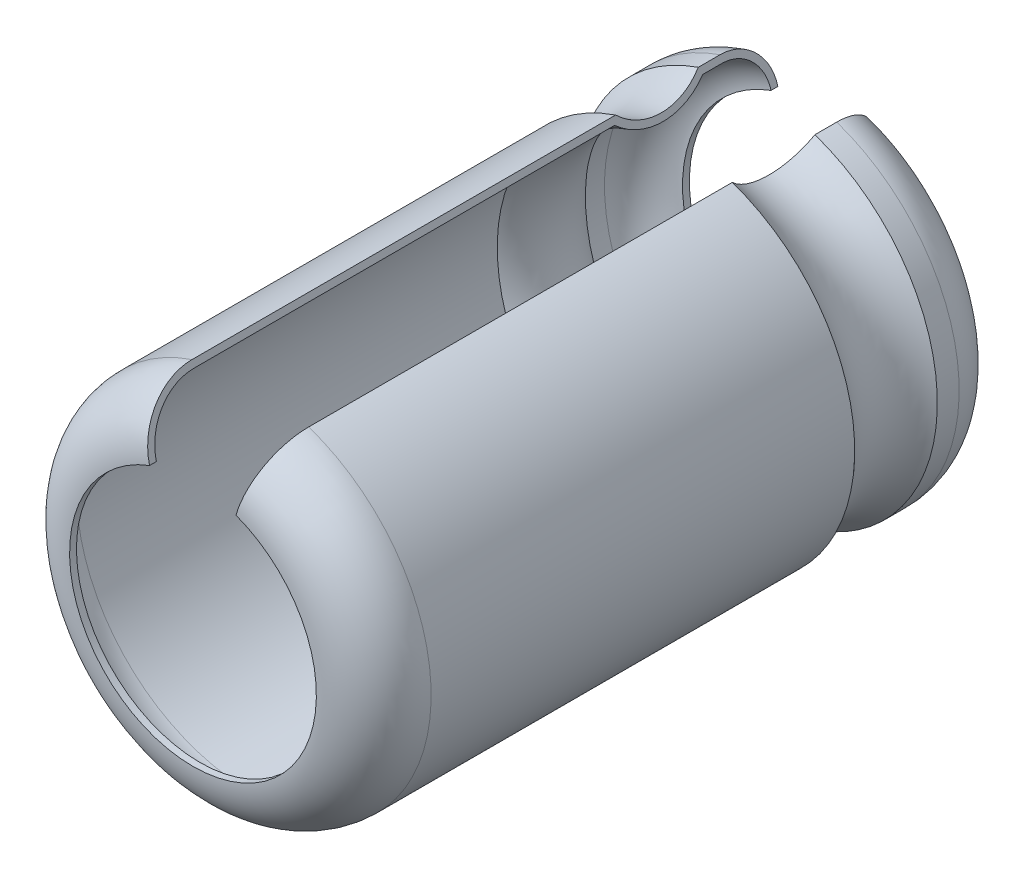
ISO-10303-21;
HEADER;
FILE_DESCRIPTION(('STEP AP214'),'2;1');
FILE_NAME('part.step','',(''),(''),'','','');
FILE_SCHEMA(('AUTOMOTIVE_DESIGN { 1 0 10303 214 1 1 1 1 }'));
ENDSEC;
DATA;
#1=APPLICATION_CONTEXT('core data for automotive mechanical design processes');
#2=APPLICATION_PROTOCOL_DEFINITION('international standard','automotive_design',2000,#1);
#3=PRODUCT_CONTEXT('',#1,'mechanical');
#4=PRODUCT('Part','Part','',(#3));
#5=PRODUCT_RELATED_PRODUCT_CATEGORY('part','',(#4));
#6=PRODUCT_DEFINITION_FORMATION('','',#4);
#7=PRODUCT_DEFINITION_CONTEXT('part definition',#1,'design');
#8=PRODUCT_DEFINITION('design','',#6,#7);
#9=PRODUCT_DEFINITION_SHAPE('','',#8);
#10=(LENGTH_UNIT() NAMED_UNIT(*) SI_UNIT(.MILLI.,.METRE.));
#11=(NAMED_UNIT(*) PLANE_ANGLE_UNIT() SI_UNIT($,.RADIAN.));
#12=(NAMED_UNIT(*) SI_UNIT($,.STERADIAN.) SOLID_ANGLE_UNIT());
#13=UNCERTAINTY_MEASURE_WITH_UNIT(LENGTH_MEASURE(1.E-05),#10,'distance_accuracy_value','');
#14=(GEOMETRIC_REPRESENTATION_CONTEXT(3) GLOBAL_UNCERTAINTY_ASSIGNED_CONTEXT((#13)) GLOBAL_UNIT_ASSIGNED_CONTEXT((#10,
#11,#12)) REPRESENTATION_CONTEXT('',''));
#15=CARTESIAN_POINT('',(0.,0.,0.));
#16=DIRECTION('',(0.,0.,1.));
#17=DIRECTION('',(1.,0.,0.));
#18=AXIS2_PLACEMENT_3D('',#15,#16,#17);
#19=CARTESIAN_POINT('',(-102.183303397109,-58.0021041199526,-4.70000797259886));
#20=DIRECTION('',(0.,0.,-1.));
#21=DIRECTION('',(0.,1.,0.));
#22=AXIS2_PLACEMENT_3D('',#19,#20,#21);
#23=TOROIDAL_SURFACE('',#22,2.35000000000002,0.679999999999987);
#24=CARTESIAN_POINT('',(-101.380450341226,-55.7935011745006,-5.38000797259885));
#25=CARTESIAN_POINT('',(-101.370193619589,-55.7564731285324,-5.38004044292657));
#26=CARTESIAN_POINT('',(-101.359939112595,-55.7194530777049,-5.3767733749197));
#27=CARTESIAN_POINT('',(-101.339726467448,-55.6464829045763,-5.36387228330371));
#28=CARTESIAN_POINT('',(-101.329768131657,-55.6105320687746,-5.35424260990552));
#29=CARTESIAN_POINT('',(-101.310419776922,-55.5406820919637,-5.32884101803197));
#30=CARTESIAN_POINT('',(-101.301030066566,-55.5067840649961,-5.31306579833261));
#31=CARTESIAN_POINT('',(-101.283094480971,-55.4420343612053,-5.2758287346243));
#32=CARTESIAN_POINT('',(-101.27454842846,-55.4111820444102,-5.25436808875672));
#33=CARTESIAN_POINT('',(-101.258557375563,-55.3534523464937,-5.20640512410304));
#34=CARTESIAN_POINT('',(-101.251110429936,-55.3265679428088,-5.17991190699491));
#35=CARTESIAN_POINT('',(-101.237511308953,-55.2774734178036,-5.12260225720216));
#36=CARTESIAN_POINT('',(-101.231359385975,-55.2552642076052,-5.09178498377338));
#37=CARTESIAN_POINT('',(-101.220540454063,-55.2162065123359,-5.02677968656072));
#38=CARTESIAN_POINT('',(-101.215870408837,-55.1993470658777,-4.99259874562344));
#39=CARTESIAN_POINT('',(-101.20813375402,-55.1714167758341,-4.92178886276002));
#40=CARTESIAN_POINT('',(-101.20506615892,-55.1603423744455,-4.88516144109116));
#41=CARTESIAN_POINT('',(-101.201397275565,-55.1470972473639,-4.82358644302531));
#42=CARTESIAN_POINT('',(-101.200308718658,-55.1431674209913,-4.79903089231911));
#43=CARTESIAN_POINT('',(-101.198856561401,-55.1379249519486,-4.74965636537359));
#44=CARTESIAN_POINT('',(-101.198491928441,-55.1366085814251,-4.72483781519092));
#45=CARTESIAN_POINT('',(-101.198492736507,-55.1366114986457,-4.70000797259883));
#46=B_SPLINE_CURVE_WITH_KNOTS('',3,(#24,#25,#26,#27,#28,#29,#30,#31,#32,#33,#34,#35,#36,#37,#38,
#39,#40,#41,#42,#43,#44,#45),.UNSPECIFIED.,.F.,.F.,(4,2,2,2,2,2,2,2,2,2,4),(0.,
0.115116596244857,0.230154566839033,0.34525441816965,0.460330032734128,0.575199474865851,
0.690091282567701,0.804746139704743,0.919330400828832,0.993866780435561,1.06829676417038),.UNSPECIFIED.);
#47=CARTESIAN_POINT('',(-101.380450341226,-55.7935011745006,-5.38000797259884));
#48=VERTEX_POINT('',#47);
#49=CARTESIAN_POINT('',(-101.198492736507,-55.1366114986457,-4.70000797259883));
#50=VERTEX_POINT('',#49);
#51=EDGE_CURVE('E128',#48,#50,#46,.T.);
#52=ORIENTED_EDGE('',*,*,#51,.F.);
#53=CARTESIAN_POINT('',(-102.183303397109,-58.0021041199526,-5.38000797259883));
#54=DIRECTION('',(0.,0.,-1.));
#55=DIRECTION('',(-1.,0.,0.));
#56=AXIS2_PLACEMENT_3D('',#53,#54,#55);
#57=CIRCLE('',#56,2.35);
#58=CARTESIAN_POINT('',(-102.991695495783,-55.7955225522781,-5.38000797259884));
#59=VERTEX_POINT('',#58);
#60=EDGE_CURVE('E127',#48,#59,#57,.T.);
#61=ORIENTED_EDGE('',*,*,#60,.T.);
#62=CARTESIAN_POINT('',(-103.168238701411,-55.1366543391434,-4.70000797259883));
#63=CARTESIAN_POINT('',(-103.168247188603,-55.1366226645133,-4.73819242550071));
#64=CARTESIAN_POINT('',(-103.167404774271,-55.1397665976013,-4.77636674157185));
#65=CARTESIAN_POINT('',(-103.164080899312,-55.1521714678252,-4.85160325200512));
#66=CARTESIAN_POINT('',(-103.161600821129,-55.1614272456102,-4.88866635683986));
#67=CARTESIAN_POINT('',(-103.155062672932,-55.1858279468689,-4.96067316911903));
#68=CARTESIAN_POINT('',(-103.151003875045,-55.2009755867995,-4.99561589035269));
#69=CARTESIAN_POINT('',(-103.14142808588,-55.2367129184884,-5.06237061100815));
#70=CARTESIAN_POINT('',(-103.135911328104,-55.2573017388,-5.09418311064034));
#71=CARTESIAN_POINT('',(-103.123570753034,-55.303357391956,-5.15381348099106));
#72=CARTESIAN_POINT('',(-103.116745772019,-55.3288285678656,-5.1816277562763));
#73=CARTESIAN_POINT('',(-103.101985096685,-55.3839161581668,-5.23245198469534));
#74=CARTESIAN_POINT('',(-103.094049187847,-55.4135333731552,-5.25546100779536));
#75=CARTESIAN_POINT('',(-103.077273156211,-55.4761423755671,-5.29607677261858));
#76=CARTESIAN_POINT('',(-103.068430826868,-55.5091423979345,-5.31366989283923));
#77=CARTESIAN_POINT('',(-103.050110364225,-55.5775152953365,-5.34288231718407));
#78=CARTESIAN_POINT('',(-103.040632568624,-55.6128869100607,-5.35450476623613));
#79=CARTESIAN_POINT('',(-103.024532608894,-55.6729727777734,-5.36864380621674));
#80=CARTESIAN_POINT('',(-103.018009337829,-55.697317956819,-5.37290338426516));
#81=CARTESIAN_POINT('',(-103.004890074079,-55.7462797156935,-5.37858514276228));
#82=CARTESIAN_POINT('',(-102.998294199778,-55.7708958537068,-5.38001140450004));
#83=CARTESIAN_POINT('',(-102.991695495783,-55.7955225522781,-5.38000797259885));
#84=B_SPLINE_CURVE_WITH_KNOTS('',3,(#62,#63,#64,#65,#66,#67,#68,#69,#70,#71,#72,#73,#74,#75,#76,
#77,#78,#79,#80,#81,#82,#83),.UNSPECIFIED.,.F.,.F.,(4,2,2,2,2,2,2,2,2,2,4),(0.,
0.114400278446881,0.228704108446448,0.343060701079718,0.457398989713757,0.571839463176005,
0.686302065563973,0.801050243405509,0.91573791787932,0.992273284410738,1.06869832435833),.UNSPECIFIED.);
#85=CARTESIAN_POINT('',(-103.168238701411,-55.1366543391434,-4.70000797259883));
#86=VERTEX_POINT('',#85);
#87=EDGE_CURVE('E22',#86,#59,#84,.T.);
#88=ORIENTED_EDGE('',*,*,#87,.F.);
#89=CARTESIAN_POINT('',(-102.183303397109,-58.0021041199526,-4.70000797259884));
#90=DIRECTION('',(0.,0.,1.));
#91=DIRECTION('',(1.,0.,0.));
#92=AXIS2_PLACEMENT_3D('',#89,#90,#91);
#93=CIRCLE('',#92,3.03);
#94=EDGE_CURVE('E119',#86,#50,#93,.T.);
#95=ORIENTED_EDGE('',*,*,#94,.T.);
#96=EDGE_LOOP('',(#52,#61,#88,#95));
#97=FACE_BOUND('',#96,.T.);
#98=ADVANCED_FACE('F17',(#97),#23,.F.);
#99=CARTESIAN_POINT('',(-102.183303397109,-58.0021041199526,-5.50000797259884));
#100=DIRECTION('',(0.,0.,-1.));
#101=DIRECTION('',(-1.,0.,0.));
#102=AXIS2_PLACEMENT_3D('',#99,#100,#101);
#103=CYLINDRICAL_SURFACE('',#102,2.35);
#104=ORIENTED_EDGE('',*,*,#60,.F.);
#105=DIRECTION('',(0.,0.,-1.));
#106=VECTOR('',#105,1.);
#107=CARTESIAN_POINT('',(-101.380450341226,-55.7935011745006,-5.50000797259884));
#108=LINE('',#107,#106);
#109=CARTESIAN_POINT('',(-101.380450341226,-55.7935011745006,-5.50000797259884));
#110=VERTEX_POINT('',#109);
#111=EDGE_CURVE('E144',#110,#48,#108,.F.);
#112=ORIENTED_EDGE('',*,*,#111,.F.);
#113=CARTESIAN_POINT('',(-102.183303397109,-58.0021041199526,-5.50000797259884));
#114=DIRECTION('',(0.,0.,1.));
#115=DIRECTION('',(1.,0.,0.));
#116=AXIS2_PLACEMENT_3D('',#113,#114,#115);
#117=CIRCLE('',#116,2.34999999999992);
#118=CARTESIAN_POINT('',(-102.991695495783,-55.7955225522781,-5.50000797259884));
#119=VERTEX_POINT('',#118);
#120=EDGE_CURVE('E135',#119,#110,#117,.T.);
#121=ORIENTED_EDGE('',*,*,#120,.F.);
#122=DIRECTION('',(0.,0.,-1.));
#123=VECTOR('',#122,1.);
#124=CARTESIAN_POINT('',(-102.991695495783,-55.795522552278,-5.50000797259884));
#125=LINE('',#124,#123);
#126=EDGE_CURVE('E139',#59,#119,#125,.T.);
#127=ORIENTED_EDGE('',*,*,#126,.F.);
#128=EDGE_LOOP('',(#104,#112,#121,#127));
#129=FACE_BOUND('',#128,.T.);
#130=ADVANCED_FACE('F293',(#129),#103,.F.);
#131=CARTESIAN_POINT('',(-102.183303397109,-58.0021041199526,-4.50980814949919));
#132=DIRECTION('',(0.,0.,1.));
#133=DIRECTION('',(1.,0.,0.));
#134=AXIS2_PLACEMENT_3D('',#131,#132,#133);
#135=CYLINDRICAL_SURFACE('',#134,3.03);
#136=ORIENTED_EDGE('',*,*,#94,.F.);
#137=DIRECTION('',(0.,0.,1.));
#138=VECTOR('',#137,1.);
#139=CARTESIAN_POINT('',(-103.168238701411,-55.1366543391434,-4.50980814949919));
#140=LINE('',#139,#138);
#141=CARTESIAN_POINT('',(-103.168238701411,-55.1366543391434,-4.36766285414183));
#142=VERTEX_POINT('',#141);
#143=EDGE_CURVE('E107',#142,#86,#140,.F.);
#144=ORIENTED_EDGE('',*,*,#143,.F.);
#145=CARTESIAN_POINT('',(-102.183303397109,-58.0021041199526,-4.36766285414182));
#146=DIRECTION('',(0.,0.,-1.));
#147=DIRECTION('',(0.,1.,0.));
#148=AXIS2_PLACEMENT_3D('',#145,#146,#147);
#149=CIRCLE('',#148,3.03000000000001);
#150=CARTESIAN_POINT('',(-101.198492736507,-55.1366114986457,-4.36766285414181));
#151=VERTEX_POINT('',#150);
#152=EDGE_CURVE('E272',#151,#142,#149,.T.);
#153=ORIENTED_EDGE('',*,*,#152,.F.);
#154=DIRECTION('',(0.,0.,1.));
#155=VECTOR('',#154,1.);
#156=CARTESIAN_POINT('',(-101.198492736507,-55.1366114986457,-4.50980814949919));
#157=LINE('',#156,#155);
#158=EDGE_CURVE('E120',#50,#151,#157,.T.);
#159=ORIENTED_EDGE('',*,*,#158,.F.);
#160=EDGE_LOOP('',(#136,#144,#153,#159));
#161=FACE_BOUND('',#160,.T.);
#162=ADVANCED_FACE('F130',(#161),#135,.F.);
#163=CARTESIAN_POINT('',(-102.183303397109,-58.0021041199526,-4.70000797259883));
#164=DIRECTION('',(0.,0.,-1.));
#165=DIRECTION('',(-1.,0.,0.));
#166=AXIS2_PLACEMENT_3D('',#163,#164,#165);
#167=TOROIDAL_SURFACE('',#166,2.34999999999996,0.800000000000009);
#168=CARTESIAN_POINT('',(-103.199368810584,-55.0204751900654,-4.70000797259884));
#169=CARTESIAN_POINT('',(-103.199378785318,-55.0204379638493,-4.74493641312418));
#170=CARTESIAN_POINT('',(-103.198387652645,-55.0241369213428,-4.7898529829681));
#171=CARTESIAN_POINT('',(-103.194476912161,-55.0387320035236,-4.87837793120833));
#172=CARTESIAN_POINT('',(-103.191558920058,-55.0496220983103,-4.9219873736552));
#173=CARTESIAN_POINT('',(-103.183866191699,-55.0783317513936,-5.00671267685617));
#174=CARTESIAN_POINT('',(-103.179090595329,-55.096154519685,-5.04782737227307));
#175=CARTESIAN_POINT('',(-103.167823492858,-55.1382039185586,-5.12637270836324));
#176=CARTESIAN_POINT('',(-103.161332263984,-55.1624295145218,-5.1638039428992));
#177=CARTESIAN_POINT('',(-103.146812273772,-55.2166188557162,-5.23396212342205));
#178=CARTESIAN_POINT('',(-103.138782279243,-55.246587203283,-5.26668525918337));
#179=CARTESIAN_POINT('',(-103.121415336978,-55.3114015141877,-5.32647783980558));
#180=CARTESIAN_POINT('',(-103.112078138525,-55.3462484132167,-5.35354619760968));
#181=CARTESIAN_POINT('',(-103.092341532381,-55.4199064301136,-5.40132080660216));
#182=CARTESIAN_POINT('',(-103.081939712501,-55.4587265503969,-5.42201216397439));
#183=CARTESIAN_POINT('',(-103.060388263871,-55.5391576516605,-5.45636677497446));
#184=CARTESIAN_POINT('',(-103.04923903229,-55.5807671503881,-5.4700337283675));
#185=CARTESIAN_POINT('',(-103.030303647275,-55.651434969323,-5.48665409186292));
#186=CARTESIAN_POINT('',(-103.022633853254,-55.680059030294,-5.49165957220919));
#187=CARTESIAN_POINT('',(-103.007208884843,-55.7376257961087,-5.49833613325166));
#188=CARTESIAN_POINT('',(-102.999453849753,-55.7665679810782,-5.50001201894142));
#189=CARTESIAN_POINT('',(-102.991695495783,-55.7955225522781,-5.50000797259884));
#190=B_SPLINE_CURVE_WITH_KNOTS('',3,(#168,#169,#170,#171,#172,#173,#174,#175,#176,#177,#178,
#179,#180,#181,#182,#183,#184,#185,#186,#187,#188,#189),.UNSPECIFIED.,.F.,.F.,(4,2,2,2,2,2,2,2,
2,2,4),(0.,0.134605317767995,0.269097909588953,0.403652848989142,0.538186059225175,
0.672827540936546,0.80749488193471,0.942474402822807,1.07738275673046,1.16736871131629,
1.25722471107065),.UNSPECIFIED.);
#191=CARTESIAN_POINT('',(-103.199368810584,-55.0204751900654,-4.70000797259884));
#192=VERTEX_POINT('',#191);
#193=EDGE_CURVE('E212',#192,#119,#190,.T.);
#194=ORIENTED_EDGE('',*,*,#193,.T.);
#195=ORIENTED_EDGE('',*,*,#120,.T.);
#196=CARTESIAN_POINT('',(-101.380450341226,-55.7935011745006,-5.50000797259884));
#197=CARTESIAN_POINT('',(-101.368385278071,-55.7499447898287,-5.50004627126708));
#198=CARTESIAN_POINT('',(-101.356322790121,-55.7063977019684,-5.49620361420081));
#199=CARTESIAN_POINT('',(-101.332546408327,-55.6205619945041,-5.48102891395987));
#200=CARTESIAN_POINT('',(-101.320832282098,-55.5782725359607,-5.46970198607633));
#201=CARTESIAN_POINT('',(-101.298072518044,-55.4961069454905,-5.43982250294661));
#202=CARTESIAN_POINT('',(-101.287027245547,-55.4562321324477,-5.42126603931987));
#203=CARTESIAN_POINT('',(-101.265929371891,-55.3800661738501,-5.37746358079339));
#204=CARTESIAN_POINT('',(-101.255876561445,-55.3437742727507,-5.35221900040055));
#205=CARTESIAN_POINT('',(-101.237066488026,-55.2758675587105,-5.29580037020729));
#206=CARTESIAN_POINT('',(-101.228306888523,-55.2442443106089,-5.26463725273348));
#207=CARTESIAN_POINT('',(-101.212310508867,-55.1864953824259,-5.19722626461126));
#208=CARTESIAN_POINT('',(-101.205074026569,-55.1603707776389,-5.16097740171867));
#209=CARTESIAN_POINT('',(-101.192346720777,-55.1144236143478,-5.08451136666863));
#210=CARTESIAN_POINT('',(-101.186852503574,-55.0945888041276,-5.04430211169449));
#211=CARTESIAN_POINT('',(-101.177750021932,-55.0617277086864,-4.96100382357785));
#212=CARTESIAN_POINT('',(-101.174140601494,-55.0486972501623,-4.9179165739274));
#213=CARTESIAN_POINT('',(-101.169822070645,-55.0331068144993,-4.84546555182945));
#214=CARTESIAN_POINT('',(-101.168540329019,-55.0284795671665,-4.81656267930479));
#215=CARTESIAN_POINT('',(-101.166830459815,-55.0223067258091,-4.75844662051833));
#216=CARTESIAN_POINT('',(-101.166401116266,-55.0207567419838,-4.72923393614812));
#217=CARTESIAN_POINT('',(-101.166402068602,-55.0207601800354,-4.70000797259884));
#218=B_SPLINE_CURVE_WITH_KNOTS('',3,(#196,#197,#198,#199,#200,#201,#202,#203,#204,#205,#206,
#207,#208,#209,#210,#211,#212,#213,#214,#215,#216,#217),.UNSPECIFIED.,.F.,.F.,(4,2,2,2,2,2,2,2,
2,2,4),(0.,0.135412750442454,0.270733045634015,0.406126598468236,0.54149153899714,
0.67660883235841,0.81175252426284,0.946631333100108,1.08142731946295,1.16916036060342,
1.25676815797506),.UNSPECIFIED.);
#219=CARTESIAN_POINT('',(-101.166402068602,-55.0207601800354,-4.70000797259884));
#220=VERTEX_POINT('',#219);
#221=EDGE_CURVE('E132',#110,#220,#218,.T.);
#222=ORIENTED_EDGE('',*,*,#221,.T.);
#223=CARTESIAN_POINT('',(-102.183303397109,-58.0021041199526,-4.70000797259884));
#224=DIRECTION('',(0.,0.,1.));
#225=DIRECTION('',(1.,0.,0.));
#226=AXIS2_PLACEMENT_3D('',#223,#224,#225);
#227=CIRCLE('',#226,3.15);
#228=EDGE_CURVE('E182',#192,#220,#227,.T.);
#229=ORIENTED_EDGE('',*,*,#228,.F.);
#230=EDGE_LOOP('',(#194,#195,#222,#229));
#231=FACE_BOUND('',#230,.T.);
#232=ADVANCED_FACE('F222',(#231),#167,.T.);
#233=CARTESIAN_POINT('',(-102.183303397109,-58.0021041199526,0.810125243112793));
#234=DIRECTION('',(0.,0.,1.));
#235=DIRECTION('',(1.,0.,0.));
#236=AXIS2_PLACEMENT_3D('',#233,#234,#235);
#237=CYLINDRICAL_SURFACE('',#236,3.03);
#238=CARTESIAN_POINT('',(-102.183303397109,-58.0021041199526,-2.8316870134333));
#239=DIRECTION('',(0.,0.,1.));
#240=DIRECTION('',(0.,-1.,0.));
#241=AXIS2_PLACEMENT_3D('',#238,#239,#240);
#242=CIRCLE('',#241,3.02999999999999);
#243=CARTESIAN_POINT('',(-103.168238701411,-55.1366543391434,-2.8316870134333));
#244=VERTEX_POINT('',#243);
#245=CARTESIAN_POINT('',(-101.198492736507,-55.1366114986457,-2.83168701343331));
#246=VERTEX_POINT('',#245);
#247=EDGE_CURVE('E268',#244,#246,#242,.T.);
#248=ORIENTED_EDGE('',*,*,#247,.F.);
#249=DIRECTION('',(0.,0.,1.));
#250=VECTOR('',#249,1.);
#251=CARTESIAN_POINT('',(-103.168238701411,-55.1366543391434,-7.97259882290291E-06));
#252=LINE('',#251,#250);
#253=CARTESIAN_POINT('',(-103.168238701411,-55.1366543391433,4.49999202740116));
#254=VERTEX_POINT('',#253);
#255=EDGE_CURVE('E258',#244,#254,#252,.T.);
#256=ORIENTED_EDGE('',*,*,#255,.T.);
#257=CARTESIAN_POINT('',(-102.183303397109,-58.0021041199526,4.49999202740116));
#258=DIRECTION('',(0.,0.,1.));
#259=DIRECTION('',(1.,0.,0.));
#260=AXIS2_PLACEMENT_3D('',#257,#258,#259);
#261=CIRCLE('',#260,3.03);
#262=CARTESIAN_POINT('',(-101.198492736507,-55.1366114986457,4.49999202740116));
#263=VERTEX_POINT('',#262);
#264=EDGE_CURVE('E218',#254,#263,#261,.T.);
#265=ORIENTED_EDGE('',*,*,#264,.T.);
#266=DIRECTION('',(0.,0.,1.));
#267=VECTOR('',#266,1.);
#268=CARTESIAN_POINT('',(-101.198492736507,-55.1366114986457,0.));
#269=LINE('',#268,#267);
#270=EDGE_CURVE('E240',#263,#246,#269,.F.);
#271=ORIENTED_EDGE('',*,*,#270,.T.);
#272=EDGE_LOOP('',(#248,#256,#265,#271));
#273=FACE_BOUND('',#272,.T.);
#274=ADVANCED_FACE('F196',(#273),#237,.F.);
#275=CARTESIAN_POINT('',(-102.183303397109,-58.0021041199526,-3.59967493378755));
#276=DIRECTION('',(0.,0.,-1.));
#277=DIRECTION('',(0.,1.,0.));
#278=AXIS2_PLACEMENT_3D('',#275,#276,#277);
#279=TOROIDAL_SURFACE('',#278,3.87090333435166,1.13882565106946);
#280=CARTESIAN_POINT('',(-103.168238701411,-55.1366543391434,-4.36766285414182));
#281=CARTESIAN_POINT('',(-103.162642491214,-55.1575396799303,-4.34404430507189));
#282=CARTESIAN_POINT('',(-103.157306443181,-55.1774540822979,-4.31952613097968));
#283=CARTESIAN_POINT('',(-103.147186898964,-55.2152207354682,-4.26884426337275));
#284=CARTESIAN_POINT('',(-103.142403383931,-55.2330730566087,-4.24268062603211));
#285=CARTESIAN_POINT('',(-103.128943010349,-55.283307854704,-4.16203095950649));
#286=CARTESIAN_POINT('',(-103.121139209682,-55.3124320352864,-4.10531382367499));
#287=CARTESIAN_POINT('',(-103.108108449266,-55.3610634952222,-3.98761660963492));
#288=CARTESIAN_POINT('',(-103.102882918574,-55.3805654412612,-3.92663418863817));
#289=CARTESIAN_POINT('',(-103.095161445725,-55.4093823702426,-3.80215073157813));
#290=CARTESIAN_POINT('',(-103.092664749771,-55.4187001663943,-3.73865039607374));
#291=CARTESIAN_POINT('',(-103.090474877393,-55.4268728813707,-3.61105011090485));
#292=CARTESIAN_POINT('',(-103.090776651889,-55.4257466436196,-3.5469514494989));
#293=CARTESIAN_POINT('',(-103.094163609646,-55.4131063451867,-3.4198327238548));
#294=CARTESIAN_POINT('',(-103.097249901329,-55.4015881478195,-3.35681309932481));
#295=CARTESIAN_POINT('',(-103.106114863012,-55.3685036604088,-3.23368910680917));
#296=CARTESIAN_POINT('',(-103.111893120365,-55.3469389103886,-3.17358429357432));
#297=CARTESIAN_POINT('',(-103.125973951966,-55.2943885314415,-3.05801466116261));
#298=CARTESIAN_POINT('',(-103.134273261856,-55.2634150852624,-3.00254395928749));
#299=CARTESIAN_POINT('',(-103.14744876732,-55.2142434294581,-2.92939976225895));
#300=CARTESIAN_POINT('',(-103.151374124308,-55.1995937977384,-2.90909215039443));
#301=CARTESIAN_POINT('',(-103.159558834685,-55.1690480427678,-2.86956700930124));
#302=CARTESIAN_POINT('',(-103.163817581924,-55.1531541816969,-2.85034760641221));
#303=CARTESIAN_POINT('',(-103.168238701411,-55.1366543391434,-2.8316870134333));
#304=B_SPLINE_CURVE_WITH_KNOTS('',3,(#280,#281,#282,#283,#284,#285,#286,#287,#288,#289,#290,
#291,#292,#293,#294,#295,#296,#297,#298,#299,#300,#301,#302,#303),.UNSPECIFIED.,.F.,.F.,(4,2,2,
2,2,2,2,2,2,2,2,4),(0.,0.0960046075440339,0.192005939387046,0.383718292499265,0.575536786952144,
0.767302281198994,0.958721854076197,1.15021765820473,1.34168411783741,1.53290370841602,
1.60889711273796,1.68475542381574),.UNSPECIFIED.);
#305=EDGE_CURVE('E115',#142,#244,#304,.T.);
#306=ORIENTED_EDGE('',*,*,#305,.T.);
#307=ORIENTED_EDGE('',*,*,#247,.T.);
#308=CARTESIAN_POINT('',(-101.198492736507,-55.1366114986457,-2.83168701343332));
#309=CARTESIAN_POINT('',(-101.20426372336,-55.1574454818652,-2.85531464130312));
#310=CARTESIAN_POINT('',(-101.209766141486,-55.1773098984384,-2.87984215721686));
#311=CARTESIAN_POINT('',(-101.220200658919,-55.2149798094342,-2.93054273570695));
#312=CARTESIAN_POINT('',(-101.225132779478,-55.2327853805727,-2.95671573691372));
#313=CARTESIAN_POINT('',(-101.239010352684,-55.2828851528752,-3.03739189510687));
#314=CARTESIAN_POINT('',(-101.24705490123,-55.3119269777273,-3.09412555979166));
#315=CARTESIAN_POINT('',(-101.260485882455,-55.3604144972056,-3.21185123857168));
#316=CARTESIAN_POINT('',(-101.265870881654,-55.3798550167926,-3.27284552894459));
#317=CARTESIAN_POINT('',(-101.273826410311,-55.4085754687281,-3.39734929837576));
#318=CARTESIAN_POINT('',(-101.276397692902,-55.4178581199825,-3.46085809966918));
#319=CARTESIAN_POINT('',(-101.27865049849,-55.425991029484,-3.58849819671718));
#320=CARTESIAN_POINT('',(-101.278336086955,-55.4248559645788,-3.65262848959963));
#321=CARTESIAN_POINT('',(-101.274835532322,-55.4122185252085,-3.77980851406507));
#322=CARTESIAN_POINT('',(-101.271648241408,-55.4007120069779,-3.84285780348769));
#323=CARTESIAN_POINT('',(-101.262494769909,-55.3676668317847,-3.96604708725425));
#324=CARTESIAN_POINT('',(-101.256528615548,-55.3461282694879,-4.02618710904511));
#325=CARTESIAN_POINT('',(-101.241990172887,-55.2936426759258,-4.14181987917302));
#326=CARTESIAN_POINT('',(-101.233421284766,-55.2627079197278,-4.19731857096242));
#327=CARTESIAN_POINT('',(-101.219837568257,-55.2136690068008,-4.27038674428785));
#328=CARTESIAN_POINT('',(-101.215806437913,-55.1991161228518,-4.29060030748223));
#329=CARTESIAN_POINT('',(-101.207402727287,-55.1687776780395,-4.32994687871364));
#330=CARTESIAN_POINT('',(-101.203030764672,-55.1529943470301,-4.34908173790999));
#331=CARTESIAN_POINT('',(-101.198492736507,-55.1366114986457,-4.36766285414181));
#332=B_SPLINE_CURVE_WITH_KNOTS('',3,(#308,#309,#310,#311,#312,#313,#314,#315,#316,#317,#318,
#319,#320,#321,#322,#323,#324,#325,#326,#327,#328,#329,#330,#331),.UNSPECIFIED.,.F.,.F.,(4,2,2,
2,2,2,2,2,2,2,2,4),(0.,0.0960173188838626,0.19203105885433,0.383764295196861,0.575600761993426,
0.767385868311948,0.958900822497749,1.15049232767277,1.34208202496241,1.53342250063315,
1.60907286815092,1.68458919177717),.UNSPECIFIED.);
#333=EDGE_CURVE('E234',#246,#151,#332,.T.);
#334=ORIENTED_EDGE('',*,*,#333,.T.);
#335=ORIENTED_EDGE('',*,*,#152,.T.);
#336=EDGE_LOOP('',(#306,#307,#334,#335));
#337=FACE_BOUND('',#336,.T.);
#338=ADVANCED_FACE('F228',(#337),#279,.T.);
#339=CARTESIAN_POINT('',(-102.183303397109,-58.0021041199526,4.49999202740116));
#340=DIRECTION('',(0.,0.,-1.));
#341=DIRECTION('',(-1.,0.,0.));
#342=AXIS2_PLACEMENT_3D('',#339,#340,#341);
#343=TOROIDAL_SURFACE('',#342,2.14999999999998,0.879999999999997);
#344=ORIENTED_EDGE('',*,*,#264,.F.);
#345=CARTESIAN_POINT('',(-103.168238701411,-55.1366543391433,4.49999202740116));
#346=CARTESIAN_POINT('',(-103.16824967581,-55.1366133821267,4.54940530178423));
#347=CARTESIAN_POINT('',(-103.167159583998,-55.1406816601551,4.59880550381118));
#348=CARTESIAN_POINT('',(-103.16285840222,-55.1567338890825,4.69616695944314));
#349=CARTESIAN_POINT('',(-103.159649095063,-55.1687111864501,4.74412938716404));
#350=CARTESIAN_POINT('',(-103.151188409286,-55.2002868956365,4.83731169569698));
#351=CARTESIAN_POINT('',(-103.145936085924,-55.2198888332797,4.88253029649562));
#352=CARTESIAN_POINT('',(-103.133544314058,-55.2661355554819,4.96891587016471));
#353=CARTESIAN_POINT('',(-103.126405168586,-55.2927792091041,5.01008349218814));
#354=CARTESIAN_POINT('',(-103.110435728998,-55.3523779690142,5.08724679671678));
#355=CARTESIAN_POINT('',(-103.101604017739,-55.3853383641519,5.1232381007023));
#356=CARTESIAN_POINT('',(-103.082503360633,-55.4566229869293,5.18900348828952));
#357=CARTESIAN_POINT('',(-103.072234142812,-55.4949482295936,5.21877639271273));
#358=CARTESIAN_POINT('',(-103.050525955358,-55.575964288112,5.27133168673686));
#359=CARTESIAN_POINT('',(-103.039084149316,-55.6186656895892,5.2940965657771));
#360=CARTESIAN_POINT('',(-103.015377972792,-55.7071383448313,5.33189914017245));
#361=CARTESIAN_POINT('',(-103.003114029655,-55.7529080037174,5.34694081537106));
#362=CARTESIAN_POINT('',(-102.982267231878,-55.8307093121979,5.36525806582877));
#363=CARTESIAN_POINT('',(-102.973811970199,-55.8622647783763,5.37078120474751));
#364=CARTESIAN_POINT('',(-102.956807188629,-55.9257274871661,5.37814778781037));
#365=CARTESIAN_POINT('',(-102.948257823491,-55.957634152235,5.37999656516677));
#366=CARTESIAN_POINT('',(-102.939704849958,-55.989554284016,5.37999202740116));
#367=B_SPLINE_CURVE_WITH_KNOTS('',3,(#345,#346,#347,#348,#349,#350,#351,#352,#353,#354,#355,
#356,#357,#358,#359,#360,#361,#362,#363,#364,#365,#366),.UNSPECIFIED.,.F.,.F.,(4,2,2,2,2,2,2,2,
2,2,4),(0.,0.148041816334832,0.29595924959495,0.443945165045521,0.591907327600337,
0.739993920729451,0.888108569679137,1.03659035556043,1.18499555032089,1.28419903773888,
1.38325842916496),.UNSPECIFIED.);
#368=CARTESIAN_POINT('',(-102.939704849958,-55.989554284016,5.37999202740116));
#369=VERTEX_POINT('',#368);
#370=EDGE_CURVE('E208',#254,#369,#367,.T.);
#371=ORIENTED_EDGE('',*,*,#370,.T.);
#372=CARTESIAN_POINT('',(-102.183303397109,-58.0021041199526,5.37999202740116));
#373=DIRECTION('',(0.,0.,1.));
#374=DIRECTION('',(0.,-1.,0.));
#375=AXIS2_PLACEMENT_3D('',#372,#373,#374);
#376=CIRCLE('',#375,2.15000000000002);
#377=CARTESIAN_POINT('',(-101.434019756797,-55.9868934544485,5.37999202740116));
#378=VERTEX_POINT('',#377);
#379=EDGE_CURVE('E261',#369,#378,#376,.T.);
#380=ORIENTED_EDGE('',*,*,#379,.T.);
#381=CARTESIAN_POINT('',(-101.434019756798,-55.9868934544485,5.37999202740116));
#382=CARTESIAN_POINT('',(-101.420740019757,-55.9389519453624,5.38003435381964));
#383=CARTESIAN_POINT('',(-101.407462964679,-55.8910201184956,5.37580710275551));
#384=CARTESIAN_POINT('',(-101.381292115517,-55.79654008481,5.35911028466961));
#385=CARTESIAN_POINT('',(-101.368398073115,-55.7499909815358,5.34664618531533));
#386=CARTESIAN_POINT('',(-101.343345564033,-55.6595482951996,5.31376261359982));
#387=CARTESIAN_POINT('',(-101.331187512015,-55.6156562091201,5.2933387039433));
#388=CARTESIAN_POINT('',(-101.307964625267,-55.5318186878902,5.2451243846864));
#389=CARTESIAN_POINT('',(-101.296899551567,-55.4918723900292,5.21733559026646));
#390=CARTESIAN_POINT('',(-101.276200631257,-55.4171467028371,5.15524052207747));
#391=CARTESIAN_POINT('',(-101.266563640691,-55.382355963427,5.12094895578865));
#392=CARTESIAN_POINT('',(-101.248965811061,-55.3188256008513,5.04677035975202));
#393=CARTESIAN_POINT('',(-101.241005301362,-55.2900871667308,5.00688223305547));
#394=CARTESIAN_POINT('',(-101.227007688117,-55.2395540348995,4.92275072730757));
#395=CARTESIAN_POINT('',(-101.220966345571,-55.2177440338653,4.87851723335949));
#396=CARTESIAN_POINT('',(-101.210958550067,-55.181614642325,4.78688380685449));
#397=CARTESIAN_POINT('',(-101.206990819166,-55.1672906382849,4.73948584488552));
#398=CARTESIAN_POINT('',(-101.202247029094,-55.1501649637205,4.65982150577887));
#399=CARTESIAN_POINT('',(-101.20083999859,-55.1450854078923,4.62806242259793));
#400=CARTESIAN_POINT('',(-101.198963000345,-55.1383092098269,4.56420406929883));
#401=CARTESIAN_POINT('',(-101.198491696433,-55.13660774385,4.53210535015203));
#402=CARTESIAN_POINT('',(-101.198492736507,-55.1366114986457,4.49999202740116));
#403=B_SPLINE_CURVE_WITH_KNOTS('',3,(#381,#382,#383,#384,#385,#386,#387,#388,#389,#390,#391,
#392,#393,#394,#395,#396,#397,#398,#399,#400,#401,#402),.UNSPECIFIED.,.F.,.F.,(4,2,2,2,2,2,2,2,
2,2,4),(0.,0.149046704418886,0.297994570021971,0.447025587509032,0.596023948261535,
0.744689250508492,0.893383732575288,1.04174746141543,1.19001964724953,1.28642041813018,
1.38268343434934),.UNSPECIFIED.);
#404=EDGE_CURVE('E184',#378,#263,#403,.T.);
#405=ORIENTED_EDGE('',*,*,#404,.T.);
#406=EDGE_LOOP('',(#344,#371,#380,#405));
#407=FACE_BOUND('',#406,.T.);
#408=ADVANCED_FACE('F171',(#407),#343,.F.);
#409=CARTESIAN_POINT('',(-102.385898101363,-58.0563892073482,-7.97259882290291E-06));
#410=DIRECTION('',(-0.965925826289121,-0.258819045102325,0.));
#411=DIRECTION('',(0.258819045102325,-0.965925826289121,0.));
#412=AXIS2_PLACEMENT_3D('',#409,#410,#411);
#413=PLANE('',#412);
#414=CARTESIAN_POINT('',(-103.199368810584,-55.0204751900654,-2.87974154117557));
#415=CARTESIAN_POINT('',(-103.19412207488,-55.0400562742861,-2.89999594332558));
#416=CARTESIAN_POINT('',(-103.189098703289,-55.0588037522891,-2.92109484895339));
#417=CARTESIAN_POINT('',(-103.179529068177,-55.0945181167357,-2.96484901779328));
#418=CARTESIAN_POINT('',(-103.174982787783,-55.1114850661506,-2.98750422591721));
#419=CARTESIAN_POINT('',(-103.162118036801,-55.1594969704458,-3.05753452874571));
#420=CARTESIAN_POINT('',(-103.154557066216,-55.1877148968217,-3.10703845865527));
#421=CARTESIAN_POINT('',(-103.141694733849,-55.2357177747199,-3.21025275134439));
#422=CARTESIAN_POINT('',(-103.13639459704,-55.2554981545759,-3.26396537588835));
#423=CARTESIAN_POINT('',(-103.128207916733,-55.2860512614282,-3.37406550774099));
#424=CARTESIAN_POINT('',(-103.12532086304,-55.2968258924945,-3.43045244695838));
#425=CARTESIAN_POINT('',(-103.122046783849,-55.3090449223857,-3.54420346861257));
#426=CARTESIAN_POINT('',(-103.121655655051,-55.3105046349309,-3.60156579173418));
#427=CARTESIAN_POINT('',(-103.123373864103,-55.3040921914513,-3.71574135226865));
#428=CARTESIAN_POINT('',(-103.125483679359,-55.2962182537201,-3.77255448275839));
#429=CARTESIAN_POINT('',(-103.132140183657,-55.2713758414782,-3.88396361551193));
#430=CARTESIAN_POINT('',(-103.136685303838,-55.254413222037,-3.93856102084812));
#431=CARTESIAN_POINT('',(-103.14808090546,-55.2118842578013,-4.04402332345134));
#432=CARTESIAN_POINT('',(-103.154930107553,-55.186322687599,-4.09489027301549));
#433=CARTESIAN_POINT('',(-103.168051560121,-55.1373527599451,-4.17508880161275));
#434=CARTESIAN_POINT('',(-103.173734953882,-55.1161420456717,-4.20588369390318));
#435=CARTESIAN_POINT('',(-103.185940119689,-55.0705917467648,-4.26481118745035));
#436=CARTESIAN_POINT('',(-103.192460667181,-55.046256732231,-4.29294757512221));
#437=CARTESIAN_POINT('',(-103.199368810584,-55.0204751900654,-4.31960832639953));
#438=B_SPLINE_CURVE_WITH_KNOTS('',3,(#414,#415,#416,#417,#418,#419,#420,#421,#422,#423,#424,
#425,#426,#427,#428,#429,#430,#431,#432,#433,#434,#435,#436,#437),.UNSPECIFIED.,.F.,.F.,(4,2,2,
2,2,2,2,2,2,2,2,4),(0.,0.0859165765390637,0.171830113471215,0.343388570629359,0.515039864587021,
0.686654857419971,0.857987642470264,1.02935313861381,1.20060837095201,1.37176866985194,
1.48501828661359,1.59810409461702),.UNSPECIFIED.);
#439=CARTESIAN_POINT('',(-103.199368810584,-55.0204751900654,-2.87974154117556));
#440=VERTEX_POINT('',#439);
#441=CARTESIAN_POINT('',(-103.199368810584,-55.0204751900654,-4.31960832639954));
#442=VERTEX_POINT('',#441);
#443=EDGE_CURVE('E176',#440,#442,#438,.T.);
#444=ORIENTED_EDGE('',*,*,#443,.F.);
#445=DIRECTION('',(0.,0.,1.));
#446=VECTOR('',#445,1.);
#447=CARTESIAN_POINT('',(-103.199368810584,-55.0204751900654,0.810125243112793));
#448=LINE('',#447,#446);
#449=CARTESIAN_POINT('',(-103.199368810584,-55.0204751900653,4.49999202740116));
#450=VERTEX_POINT('',#449);
#451=EDGE_CURVE('E263',#450,#440,#448,.F.);
#452=ORIENTED_EDGE('',*,*,#451,.F.);
#453=CARTESIAN_POINT('',(-102.939704849958,-55.989554284016,5.49999202740117));
#454=CARTESIAN_POINT('',(-102.947031112622,-55.962212299523,5.49999182410954));
#455=CARTESIAN_POINT('',(-102.95435392153,-55.9348832046247,5.49880082035709));
#456=CARTESIAN_POINT('',(-102.968947561075,-55.8804190003734,5.49404658734078));
#457=CARTESIAN_POINT('',(-102.976218393055,-55.853283886011,5.49048341956241));
#458=CARTESIAN_POINT('',(-102.997864227431,-55.7725005323495,5.47626387152472));
#459=CARTESIAN_POINT('',(-103.0120948124,-55.7193912662229,5.46207737926669));
#460=CARTESIAN_POINT('',(-103.039737748354,-55.6162264247709,5.42466291710191));
#461=CARTESIAN_POINT('',(-103.05314961479,-55.566172657808,5.40142965184278));
#462=CARTESIAN_POINT('',(-103.078768157931,-55.4705629531912,5.34657099526357));
#463=CARTESIAN_POINT('',(-103.090975114342,-55.4250059716575,5.31494755794654));
#464=CARTESIAN_POINT('',(-103.113799500178,-55.3398242040667,5.24430373970885));
#465=CARTESIAN_POINT('',(-103.124421502617,-55.3001823512854,5.20530540571163));
#466=CARTESIAN_POINT('',(-103.14381636115,-55.2277997538351,5.12094390651245));
#467=CARTESIAN_POINT('',(-103.152588851901,-55.1950603726431,5.07557948673062));
#468=CARTESIAN_POINT('',(-103.168006947167,-55.1375192577557,4.97992488013096));
#469=CARTESIAN_POINT('',(-103.174658419478,-55.1126956251449,4.92964879448366));
#470=CARTESIAN_POINT('',(-103.185674186417,-55.0715842232459,4.8255008674203));
#471=CARTESIAN_POINT('',(-103.190039905366,-55.0552911383158,4.77163128887143));
#472=CARTESIAN_POINT('',(-103.195250931692,-55.0358433233061,4.68118001833653));
#473=CARTESIAN_POINT('',(-103.196794234268,-55.0300836396818,4.64517574399302));
#474=CARTESIAN_POINT('',(-103.198853004061,-55.0224002062153,4.57278343856601));
#475=CARTESIAN_POINT('',(-103.199369939401,-55.0204709772608,4.53639603058137));
#476=CARTESIAN_POINT('',(-103.199368810583,-55.0204751900653,4.49999202740116));
#477=B_SPLINE_CURVE_WITH_KNOTS('',3,(#453,#454,#455,#456,#457,#458,#459,#460,#461,#462,#463,
#464,#465,#466,#467,#468,#469,#470,#471,#472,#473,#474,#475,#476),.UNSPECIFIED.,.F.,.F.,(4,2,2,
2,2,2,2,2,2,2,2,4),(0.,0.0848678290191825,0.169733458385397,0.339210153574027,0.5087861981249,
0.678322784403838,0.847360339106118,1.01643125335111,1.18503029131515,1.35352414471141,
1.4628054919102,1.57193040927829),.UNSPECIFIED.);
#478=CARTESIAN_POINT('',(-102.939704849958,-55.989554284016,5.49999202740116));
#479=VERTEX_POINT('',#478);
#480=EDGE_CURVE('E183',#479,#450,#477,.T.);
#481=ORIENTED_EDGE('',*,*,#480,.F.);
#482=DIRECTION('',(0.,0.,1.));
#483=VECTOR('',#482,1.);
#484=CARTESIAN_POINT('',(-102.939704849958,-55.989554284016,5.96079208137704));
#485=LINE('',#484,#483);
#486=EDGE_CURVE('E264',#479,#369,#485,.F.);
#487=ORIENTED_EDGE('',*,*,#486,.T.);
#488=ORIENTED_EDGE('',*,*,#370,.F.);
#489=ORIENTED_EDGE('',*,*,#255,.F.);
#490=ORIENTED_EDGE('',*,*,#305,.F.);
#491=ORIENTED_EDGE('',*,*,#143,.T.);
#492=ORIENTED_EDGE('',*,*,#87,.T.);
#493=ORIENTED_EDGE('',*,*,#126,.T.);
#494=ORIENTED_EDGE('',*,*,#193,.F.);
#495=DIRECTION('',(0.,0.,1.));
#496=VECTOR('',#495,1.);
#497=CARTESIAN_POINT('',(-103.199368810584,-55.0204751900654,-4.50980814949919));
#498=LINE('',#497,#496);
#499=EDGE_CURVE('E249',#442,#192,#498,.F.);
#500=ORIENTED_EDGE('',*,*,#499,.F.);
#501=EDGE_LOOP('',(#444,#452,#481,#487,#488,#489,#490,#491,#492,#493,#494,#500));
#502=FACE_BOUND('',#501,.T.);
#503=ADVANCED_FACE('F110',(#502),#413,.F.);
#504=CARTESIAN_POINT('',(-102.183303397109,-58.0021041199526,-4.50980814949919));
#505=DIRECTION('',(0.,0.,1.));
#506=DIRECTION('',(1.,0.,0.));
#507=AXIS2_PLACEMENT_3D('',#504,#505,#506);
#508=CYLINDRICAL_SURFACE('',#507,3.15);
#509=CARTESIAN_POINT('',(-102.183303397109,-58.0021041199526,-4.31960832639956));
#510=DIRECTION('',(0.,0.,-1.));
#511=DIRECTION('',(-1.,0.,0.));
#512=AXIS2_PLACEMENT_3D('',#509,#510,#511);
#513=CIRCLE('',#512,3.15000000000003);
#514=CARTESIAN_POINT('',(-101.166402068602,-55.0207601800354,-4.31960832639952));
#515=VERTEX_POINT('',#514);
#516=EDGE_CURVE('E155',#515,#442,#513,.T.);
#517=ORIENTED_EDGE('',*,*,#516,.T.);
#518=ORIENTED_EDGE('',*,*,#499,.T.);
#519=ORIENTED_EDGE('',*,*,#228,.T.);
#520=DIRECTION('',(0.,0.,1.));
#521=VECTOR('',#520,1.);
#522=CARTESIAN_POINT('',(-101.166402068602,-55.0207601800354,0.));
#523=LINE('',#522,#521);
#524=EDGE_CURVE('E239',#220,#515,#523,.T.);
#525=ORIENTED_EDGE('',*,*,#524,.T.);
#526=EDGE_LOOP('',(#517,#518,#519,#525));
#527=FACE_BOUND('',#526,.T.);
#528=ADVANCED_FACE('F195',(#527),#508,.T.);
#529=CARTESIAN_POINT('',(-101.922149914419,-57.7491042810306,0.));
#530=DIRECTION('',(0.96371126814573,-0.266946795539764,0.));
#531=DIRECTION('',(0.266946795539764,0.96371126814573,0.));
#532=AXIS2_PLACEMENT_3D('',#529,#530,#531);
#533=PLANE('',#532);
#534=DIRECTION('',(0.,0.,1.));
#535=VECTOR('',#534,1.);
#536=CARTESIAN_POINT('',(-101.166402068602,-55.0207601800354,0.810125243112793));
#537=LINE('',#536,#535);
#538=CARTESIAN_POINT('',(-101.166402068602,-55.0207601800354,-2.87974154117558));
#539=VERTEX_POINT('',#538);
#540=CARTESIAN_POINT('',(-101.166402068602,-55.0207601800354,4.49999202740116));
#541=VERTEX_POINT('',#540);
#542=EDGE_CURVE('E154',#539,#541,#537,.T.);
#543=ORIENTED_EDGE('',*,*,#542,.F.);
#544=CARTESIAN_POINT('',(-101.166402068602,-55.0207601800354,-2.87974154117558));
#545=CARTESIAN_POINT('',(-101.171812533883,-55.0402926353569,-2.90000239472319));
#546=CARTESIAN_POINT('',(-101.176992442067,-55.0589927507654,-2.92110794798347));
#547=CARTESIAN_POINT('',(-101.186859853975,-55.0946153399957,-2.96487539748681));
#548=CARTESIAN_POINT('',(-101.191547376535,-55.1115378818138,-2.98753723414352));
#549=CARTESIAN_POINT('',(-101.204811018629,-55.1594212861314,-3.05758603041584));
#550=CARTESIAN_POINT('',(-101.212605534953,-55.1875604634397,-3.10710126144884));
#551=CARTESIAN_POINT('',(-101.225863795245,-55.2354244387805,-3.21033416144578));
#552=CARTESIAN_POINT('',(-101.231326308234,-55.2551447928275,-3.26405403222379));
#553=CARTESIAN_POINT('',(-101.239762773021,-55.2856014842525,-3.37416550770261));
#554=CARTESIAN_POINT('',(-101.242737231056,-55.2963396492075,-3.43055656643703));
#555=CARTESIAN_POINT('',(-101.246109584879,-55.3085142676495,-3.54433495738552));
#556=CARTESIAN_POINT('',(-101.246510746209,-55.3099625101485,-3.60172093421975));
#557=CARTESIAN_POINT('',(-101.24473360195,-55.303546797441,-3.71594245084897));
#558=CARTESIAN_POINT('',(-101.242554799511,-55.2956810485498,-3.77277788249482));
#559=CARTESIAN_POINT('',(-101.235682399593,-55.2708708266221,-3.88424080085208));
#560=CARTESIAN_POINT('',(-101.230989931923,-55.2539304323393,-3.93886926766752));
#561=CARTESIAN_POINT('',(-101.219225174301,-55.2114581881439,-4.04438858650554));
#562=CARTESIAN_POINT('',(-101.212154228029,-55.1859311890839,-4.09528152911583));
#563=CARTESIAN_POINT('',(-101.198623773862,-55.1370845598625,-4.17542171128376));
#564=CARTESIAN_POINT('',(-101.192775040605,-55.115969902416,-4.20614136458464));
#565=CARTESIAN_POINT('',(-101.180216771796,-55.07063298374,-4.26493049546362));
#566=CARTESIAN_POINT('',(-101.173508491162,-55.0464152529241,-4.29300373503792));
#567=CARTESIAN_POINT('',(-101.166402068602,-55.0207601800354,-4.31960832639952));
#568=B_SPLINE_CURVE_WITH_KNOTS('',3,(#544,#545,#546,#547,#548,#549,#550,#551,#552,#553,#554,
#555,#556,#557,#558,#559,#560,#561,#562,#563,#564,#565,#566,#567),.UNSPECIFIED.,.F.,.F.,(4,2,2,
2,2,2,2,2,2,2,2,4),(0.,0.0859219711366577,0.171840654360094,0.343406013777451,0.51506182456293,
0.686682700594315,0.85808574472136,1.02952180294675,1.20088087089614,1.37214329465904,
1.48512500885157,1.59794361286252),.UNSPECIFIED.);
#569=EDGE_CURVE('E147',#539,#515,#568,.T.);
#570=ORIENTED_EDGE('',*,*,#569,.T.);
#571=ORIENTED_EDGE('',*,*,#524,.F.);
#572=ORIENTED_EDGE('',*,*,#221,.F.);
#573=ORIENTED_EDGE('',*,*,#111,.T.);
#574=ORIENTED_EDGE('',*,*,#51,.T.);
#575=ORIENTED_EDGE('',*,*,#158,.T.);
#576=ORIENTED_EDGE('',*,*,#333,.F.);
#577=ORIENTED_EDGE('',*,*,#270,.F.);
#578=ORIENTED_EDGE('',*,*,#404,.F.);
#579=DIRECTION('',(0.,0.,1.));
#580=VECTOR('',#579,1.);
#581=CARTESIAN_POINT('',(-101.434019756797,-55.9868934544485,5.96079208137704));
#582=LINE('',#581,#580);
#583=CARTESIAN_POINT('',(-101.434019756797,-55.9868934544485,5.49999202740116));
#584=VERTEX_POINT('',#583);
#585=EDGE_CURVE('E310',#378,#584,#582,.T.);
#586=ORIENTED_EDGE('',*,*,#585,.T.);
#587=CARTESIAN_POINT('',(-101.166402068602,-55.0207601800354,4.49999202740116));
#588=CARTESIAN_POINT('',(-101.166402113905,-55.0207603435849,4.5280882814829));
#589=CARTESIAN_POINT('',(-101.166718900665,-55.0219039833488,4.5561710668203));
#590=CARTESIAN_POINT('',(-101.167982660136,-55.0264663128561,4.61213548662747));
#591=CARTESIAN_POINT('',(-101.168929601098,-55.0298848879841,4.64001713115956));
#592=CARTESIAN_POINT('',(-101.17270650411,-55.0435199795163,4.72300983286036));
#593=CARTESIAN_POINT('',(-101.176472572156,-55.0571159554661,4.77756465475873));
#594=CARTESIAN_POINT('',(-101.186395812967,-55.0929400940055,4.88352936800329));
#595=CARTESIAN_POINT('',(-101.192554104855,-55.1151722967667,4.93493777435472));
#596=CARTESIAN_POINT('',(-101.207085332914,-55.1676318447176,5.03315387143517));
#597=CARTESIAN_POINT('',(-101.215457903435,-55.1978578698631,5.07996232002033));
#598=CARTESIAN_POINT('',(-101.234184593153,-55.2654635583271,5.16768160937308));
#599=CARTESIAN_POINT('',(-101.244539861297,-55.3028473694894,5.20858900633888));
#600=CARTESIAN_POINT('',(-101.266936422978,-55.3837017540376,5.28333152809025));
#601=CARTESIAN_POINT('',(-101.27897803618,-55.4271734814494,5.3171653089622));
#602=CARTESIAN_POINT('',(-101.304425101119,-55.5190405637003,5.37685626325261));
#603=CARTESIAN_POINT('',(-101.317832989767,-55.5674447160953,5.40269884023261));
#604=CARTESIAN_POINT('',(-101.345612318396,-55.667731561519,5.44559643876557));
#605=CARTESIAN_POINT('',(-101.359983241719,-55.7196123893524,5.4626561302478));
#606=CARTESIAN_POINT('',(-101.384368338879,-55.8076456353072,5.48337126387155));
#607=CARTESIAN_POINT('',(-101.394232236025,-55.8432555358056,5.48960147902242));
#608=CARTESIAN_POINT('',(-101.41406937206,-55.9148700741465,5.4979113962807));
#609=CARTESIAN_POINT('',(-101.42404243208,-55.9508740662527,5.4999970910612));
#610=CARTESIAN_POINT('',(-101.434019756798,-55.9868934544485,5.49999202740116));
#611=B_SPLINE_CURVE_WITH_KNOTS('',3,(#587,#588,#589,#590,#591,#592,#593,#594,#595,#596,#597,
#598,#599,#600,#601,#602,#603,#604,#605,#606,#607,#608,#609,#610),.UNSPECIFIED.,.F.,.F.,(4,2,2,
2,2,2,2,2,2,2,2,4),(0.,0.0842369599185367,0.168469676146212,0.336650786391029,0.504910669513326,
0.6731427847018,0.841472684890159,1.00983453700791,1.178502120538,1.34707992932508,
1.45927990422937,1.57131752778995),.UNSPECIFIED.);
#612=EDGE_CURVE('E156',#541,#584,#611,.T.);
#613=ORIENTED_EDGE('',*,*,#612,.F.);
#614=EDGE_LOOP('',(#543,#570,#571,#572,#573,#574,#575,#576,#577,#578,#586,#613));
#615=FACE_BOUND('',#614,.T.);
#616=ADVANCED_FACE('F161',(#615),#533,.F.);
#617=CARTESIAN_POINT('',(-102.183303397109,-58.0021041199526,5.96079208137704));
#618=DIRECTION('',(0.,0.,1.));
#619=DIRECTION('',(0.,-1.,0.));
#620=AXIS2_PLACEMENT_3D('',#617,#618,#619);
#621=CYLINDRICAL_SURFACE('',#620,2.15000000000002);
#622=ORIENTED_EDGE('',*,*,#379,.F.);
#623=ORIENTED_EDGE('',*,*,#486,.F.);
#624=CARTESIAN_POINT('',(-102.183303397109,-58.0021041199526,5.49999202740116));
#625=DIRECTION('',(0.,0.,-1.));
#626=DIRECTION('',(-1.,0.,0.));
#627=AXIS2_PLACEMENT_3D('',#624,#625,#626);
#628=CIRCLE('',#627,2.15);
#629=EDGE_CURVE('E42',#584,#479,#628,.T.);
#630=ORIENTED_EDGE('',*,*,#629,.F.);
#631=ORIENTED_EDGE('',*,*,#585,.F.);
#632=EDGE_LOOP('',(#622,#623,#630,#631));
#633=FACE_BOUND('',#632,.T.);
#634=ADVANCED_FACE('F169',(#633),#621,.F.);
#635=CARTESIAN_POINT('',(-102.183303397109,-58.0021041199526,-3.59967493378755));
#636=DIRECTION('',(0.,0.,-1.));
#637=DIRECTION('',(-1.,0.,0.));
#638=AXIS2_PLACEMENT_3D('',#635,#636,#637);
#639=TOROIDAL_SURFACE('',#638,3.87090333435168,1.01882565106948);
#640=ORIENTED_EDGE('',*,*,#569,.F.);
#641=CARTESIAN_POINT('',(-102.183303397109,-58.0021041199526,-2.87974154117558));
#642=DIRECTION('',(0.,0.,1.));
#643=DIRECTION('',(1.,0.,0.));
#644=AXIS2_PLACEMENT_3D('',#641,#642,#643);
#645=CIRCLE('',#644,3.15);
#646=EDGE_CURVE('E33',#440,#539,#645,.T.);
#647=ORIENTED_EDGE('',*,*,#646,.F.);
#648=ORIENTED_EDGE('',*,*,#443,.T.);
#649=ORIENTED_EDGE('',*,*,#516,.F.);
#650=EDGE_LOOP('',(#640,#647,#648,#649));
#651=FACE_BOUND('',#650,.T.);
#652=ADVANCED_FACE('F165',(#651),#639,.F.);
#653=CARTESIAN_POINT('',(-102.183303397109,-58.0021041199526,4.49999202740117));
#654=DIRECTION('',(0.,0.,-1.));
#655=DIRECTION('',(0.,1.,0.));
#656=AXIS2_PLACEMENT_3D('',#653,#654,#655);
#657=TOROIDAL_SURFACE('',#656,2.14999999999999,0.999999999999992);
#658=ORIENTED_EDGE('',*,*,#612,.T.);
#659=ORIENTED_EDGE('',*,*,#629,.T.);
#660=ORIENTED_EDGE('',*,*,#480,.T.);
#661=CARTESIAN_POINT('',(-102.183303397109,-58.0021041199526,4.49999202740116));
#662=DIRECTION('',(0.,0.,1.));
#663=DIRECTION('',(1.,0.,0.));
#664=AXIS2_PLACEMENT_3D('',#661,#662,#663);
#665=CIRCLE('',#664,3.15);
#666=EDGE_CURVE('E11',#541,#450,#665,.F.);
#667=ORIENTED_EDGE('',*,*,#666,.F.);
#668=EDGE_LOOP('',(#658,#659,#660,#667));
#669=FACE_BOUND('',#668,.T.);
#670=ADVANCED_FACE('F19',(#669),#657,.T.);
#671=CARTESIAN_POINT('',(-102.183303397109,-58.0021041199526,0.810125243112793));
#672=DIRECTION('',(0.,0.,1.));
#673=DIRECTION('',(1.,0.,0.));
#674=AXIS2_PLACEMENT_3D('',#671,#672,#673);
#675=CYLINDRICAL_SURFACE('',#674,3.15);
#676=ORIENTED_EDGE('',*,*,#646,.T.);
#677=ORIENTED_EDGE('',*,*,#542,.T.);
#678=ORIENTED_EDGE('',*,*,#666,.T.);
#679=ORIENTED_EDGE('',*,*,#451,.T.);
#680=EDGE_LOOP('',(#676,#677,#678,#679));
#681=FACE_BOUND('',#680,.T.);
#682=ADVANCED_FACE('F325',(#681),#675,.T.);
#683=CLOSED_SHELL('',(#98,#130,#162,#232,#274,#338,#408,#503,#528,#616,#634,#652,#670,#682));
#684=MANIFOLD_SOLID_BREP('B1',#683);
#685=ADVANCED_BREP_SHAPE_REPRESENTATION('',(#18,#684),#14);
#686=SHAPE_DEFINITION_REPRESENTATION(#9,#685);
ENDSEC;
END-ISO-10303-21;
